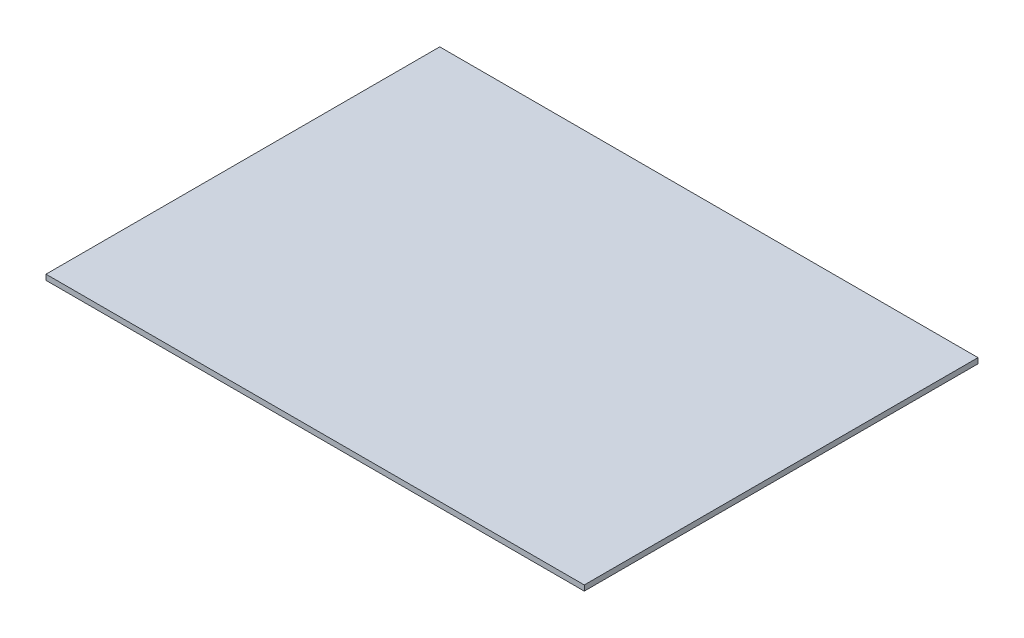
ISO-10303-21;
HEADER;
FILE_DESCRIPTION(('STEP AP214'),'2;1');
FILE_NAME('part.step','',(''),(''),'','','');
FILE_SCHEMA(('AUTOMOTIVE_DESIGN { 1 0 10303 214 1 1 1 1 }'));
ENDSEC;
DATA;
#1=APPLICATION_CONTEXT('core data for automotive mechanical design processes');
#2=APPLICATION_PROTOCOL_DEFINITION('international standard','automotive_design',2000,#1);
#3=PRODUCT_CONTEXT('',#1,'mechanical');
#4=PRODUCT('Part','Part','',(#3));
#5=PRODUCT_RELATED_PRODUCT_CATEGORY('part','',(#4));
#6=PRODUCT_DEFINITION_FORMATION('','',#4);
#7=PRODUCT_DEFINITION_CONTEXT('part definition',#1,'design');
#8=PRODUCT_DEFINITION('design','',#6,#7);
#9=PRODUCT_DEFINITION_SHAPE('','',#8);
#10=(LENGTH_UNIT() NAMED_UNIT(*) SI_UNIT(.MILLI.,.METRE.));
#11=(NAMED_UNIT(*) PLANE_ANGLE_UNIT() SI_UNIT($,.RADIAN.));
#12=(NAMED_UNIT(*) SI_UNIT($,.STERADIAN.) SOLID_ANGLE_UNIT());
#13=UNCERTAINTY_MEASURE_WITH_UNIT(LENGTH_MEASURE(1.E-05),#10,'distance_accuracy_value','');
#14=(GEOMETRIC_REPRESENTATION_CONTEXT(3) GLOBAL_UNCERTAINTY_ASSIGNED_CONTEXT((#13)) GLOBAL_UNIT_ASSIGNED_CONTEXT((#10,
#11,#12)) REPRESENTATION_CONTEXT('',''));
#15=CARTESIAN_POINT('',(0.,0.,0.));
#16=DIRECTION('',(0.,0.,1.));
#17=DIRECTION('',(1.,0.,0.));
#18=AXIS2_PLACEMENT_3D('',#15,#16,#17);
#19=CARTESIAN_POINT('',(0.,2.,0.));
#20=DIRECTION('',(1.,0.,0.));
#21=DIRECTION('',(0.,0.,-1.));
#22=AXIS2_PLACEMENT_3D('',#19,#20,#21);
#23=PLANE('',#22);
#24=DIRECTION('',(0.,0.,1.));
#25=VECTOR('',#24,1.);
#26=CARTESIAN_POINT('',(0.,0.,0.));
#27=LINE('',#26,#25);
#28=CARTESIAN_POINT('',(0.,0.,-146.293094579551));
#29=VERTEX_POINT('',#28);
#30=CARTESIAN_POINT('',(0.,0.,0.));
#31=VERTEX_POINT('',#30);
#32=EDGE_CURVE('E107',#29,#31,#27,.T.);
#33=ORIENTED_EDGE('',*,*,#32,.T.);
#34=DIRECTION('',(0.,-1.,0.));
#35=VECTOR('',#34,1.);
#36=CARTESIAN_POINT('',(0.,2.,0.));
#37=LINE('',#36,#35);
#38=CARTESIAN_POINT('',(0.,2.,0.));
#39=VERTEX_POINT('',#38);
#40=EDGE_CURVE('E11',#39,#31,#37,.T.);
#41=ORIENTED_EDGE('',*,*,#40,.F.);
#42=DIRECTION('',(0.,0.,1.));
#43=VECTOR('',#42,1.);
#44=CARTESIAN_POINT('',(0.,2.,0.));
#45=LINE('',#44,#43);
#46=CARTESIAN_POINT('',(0.,2.,-146.293094579551));
#47=VERTEX_POINT('',#46);
#48=EDGE_CURVE('E91',#47,#39,#45,.T.);
#49=ORIENTED_EDGE('',*,*,#48,.F.);
#50=DIRECTION('',(0.,-1.,0.));
#51=VECTOR('',#50,1.);
#52=CARTESIAN_POINT('',(0.,2.,-146.293094579551));
#53=LINE('',#52,#51);
#54=EDGE_CURVE('E103',#47,#29,#53,.T.);
#55=ORIENTED_EDGE('',*,*,#54,.T.);
#56=EDGE_LOOP('',(#33,#41,#49,#55));
#57=FACE_BOUND('',#56,.T.);
#58=ADVANCED_FACE('F39',(#57),#23,.F.);
#59=CARTESIAN_POINT('',(0.,2.,0.));
#60=DIRECTION('',(0.,0.,-1.));
#61=DIRECTION('',(-1.,0.,0.));
#62=AXIS2_PLACEMENT_3D('',#59,#60,#61);
#63=PLANE('',#62);
#64=DIRECTION('',(1.,0.,0.));
#65=VECTOR('',#64,1.);
#66=CARTESIAN_POINT('',(0.,0.,0.));
#67=LINE('',#66,#65);
#68=CARTESIAN_POINT('',(200.,0.,0.));
#69=VERTEX_POINT('',#68);
#70=EDGE_CURVE('E96',#31,#69,#67,.T.);
#71=ORIENTED_EDGE('',*,*,#70,.T.);
#72=DIRECTION('',(0.,-1.,0.));
#73=VECTOR('',#72,1.);
#74=CARTESIAN_POINT('',(200.,2.,0.));
#75=LINE('',#74,#73);
#76=CARTESIAN_POINT('',(200.,2.,0.));
#77=VERTEX_POINT('',#76);
#78=EDGE_CURVE('E48',#77,#69,#75,.T.);
#79=ORIENTED_EDGE('',*,*,#78,.F.);
#80=DIRECTION('',(1.,0.,0.));
#81=VECTOR('',#80,1.);
#82=CARTESIAN_POINT('',(0.,2.,0.));
#83=LINE('',#82,#81);
#84=EDGE_CURVE('E86',#39,#77,#83,.T.);
#85=ORIENTED_EDGE('',*,*,#84,.F.);
#86=ORIENTED_EDGE('',*,*,#40,.T.);
#87=EDGE_LOOP('',(#71,#79,#85,#86));
#88=FACE_BOUND('',#87,.T.);
#89=ADVANCED_FACE('F95',(#88),#63,.F.);
#90=CARTESIAN_POINT('',(200.,2.,0.));
#91=DIRECTION('',(-1.,0.,0.));
#92=DIRECTION('',(0.,0.,1.));
#93=AXIS2_PLACEMENT_3D('',#90,#91,#92);
#94=PLANE('',#93);
#95=DIRECTION('',(0.,0.,-1.));
#96=VECTOR('',#95,1.);
#97=CARTESIAN_POINT('',(200.,0.,0.));
#98=LINE('',#97,#96);
#99=CARTESIAN_POINT('',(200.,0.,-146.293094579551));
#100=VERTEX_POINT('',#99);
#101=EDGE_CURVE('E73',#69,#100,#98,.T.);
#102=ORIENTED_EDGE('',*,*,#101,.T.);
#103=DIRECTION('',(0.,-1.,0.));
#104=VECTOR('',#103,1.);
#105=CARTESIAN_POINT('',(200.,2.,-146.293094579551));
#106=LINE('',#105,#104);
#107=CARTESIAN_POINT('',(200.,2.,-146.293094579551));
#108=VERTEX_POINT('',#107);
#109=EDGE_CURVE('E98',#108,#100,#106,.T.);
#110=ORIENTED_EDGE('',*,*,#109,.F.);
#111=DIRECTION('',(0.,0.,-1.));
#112=VECTOR('',#111,1.);
#113=CARTESIAN_POINT('',(200.,2.,0.));
#114=LINE('',#113,#112);
#115=EDGE_CURVE('E89',#77,#108,#114,.T.);
#116=ORIENTED_EDGE('',*,*,#115,.F.);
#117=ORIENTED_EDGE('',*,*,#78,.T.);
#118=EDGE_LOOP('',(#102,#110,#116,#117));
#119=FACE_BOUND('',#118,.T.);
#120=ADVANCED_FACE('F99',(#119),#94,.F.);
#121=CARTESIAN_POINT('',(0.,2.,-146.293094579551));
#122=DIRECTION('',(0.,0.,1.));
#123=DIRECTION('',(1.,0.,0.));
#124=AXIS2_PLACEMENT_3D('',#121,#122,#123);
#125=PLANE('',#124);
#126=DIRECTION('',(-1.,0.,0.));
#127=VECTOR('',#126,1.);
#128=CARTESIAN_POINT('',(0.,0.,-146.293094579551));
#129=LINE('',#128,#127);
#130=EDGE_CURVE('E79',#100,#29,#129,.T.);
#131=ORIENTED_EDGE('',*,*,#130,.T.);
#132=ORIENTED_EDGE('',*,*,#54,.F.);
#133=DIRECTION('',(-1.,0.,0.));
#134=VECTOR('',#133,1.);
#135=CARTESIAN_POINT('',(0.,2.,-146.293094579551));
#136=LINE('',#135,#134);
#137=EDGE_CURVE('E56',#108,#47,#136,.T.);
#138=ORIENTED_EDGE('',*,*,#137,.F.);
#139=ORIENTED_EDGE('',*,*,#109,.T.);
#140=EDGE_LOOP('',(#131,#132,#138,#139));
#141=FACE_BOUND('',#140,.T.);
#142=ADVANCED_FACE('F120',(#141),#125,.F.);
#143=CARTESIAN_POINT('',(0.,2.,0.));
#144=DIRECTION('',(0.,-1.,0.));
#145=DIRECTION('',(0.,0.,-1.));
#146=AXIS2_PLACEMENT_3D('',#143,#144,#145);
#147=PLANE('',#146);
#148=ORIENTED_EDGE('',*,*,#48,.T.);
#149=ORIENTED_EDGE('',*,*,#84,.T.);
#150=ORIENTED_EDGE('',*,*,#115,.T.);
#151=ORIENTED_EDGE('',*,*,#137,.T.);
#152=EDGE_LOOP('',(#148,#149,#150,#151));
#153=FACE_BOUND('',#152,.T.);
#154=ADVANCED_FACE('F87',(#153),#147,.F.);
#155=CARTESIAN_POINT('',(0.,0.,0.));
#156=DIRECTION('',(0.,-1.,0.));
#157=DIRECTION('',(0.,0.,-1.));
#158=AXIS2_PLACEMENT_3D('',#155,#156,#157);
#159=PLANE('',#158);
#160=ORIENTED_EDGE('',*,*,#32,.F.);
#161=ORIENTED_EDGE('',*,*,#130,.F.);
#162=ORIENTED_EDGE('',*,*,#101,.F.);
#163=ORIENTED_EDGE('',*,*,#70,.F.);
#164=EDGE_LOOP('',(#160,#161,#162,#163));
#165=FACE_BOUND('',#164,.T.);
#166=ADVANCED_FACE('F123',(#165),#159,.T.);
#167=CLOSED_SHELL('',(#58,#89,#120,#142,#154,#166));
#168=MANIFOLD_SOLID_BREP('B2',#167);
#169=ADVANCED_BREP_SHAPE_REPRESENTATION('',(#18,#168),#14);
#170=SHAPE_DEFINITION_REPRESENTATION(#9,#169);
ENDSEC;
END-ISO-10303-21;
